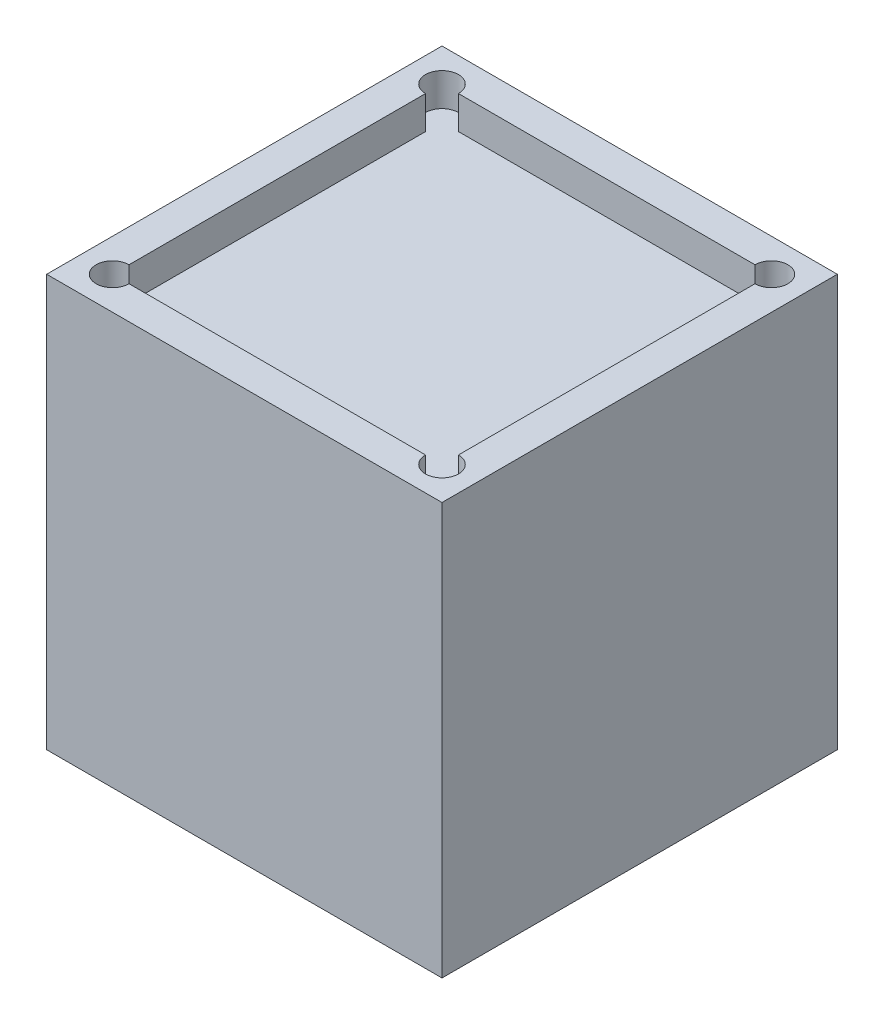
ISO-10303-21;
HEADER;
FILE_DESCRIPTION(('STEP AP214'),'2;1');
FILE_NAME('part.step','',(''),(''),'','','');
FILE_SCHEMA(('AUTOMOTIVE_DESIGN { 1 0 10303 214 1 1 1 1 }'));
ENDSEC;
DATA;
#1=APPLICATION_CONTEXT('core data for automotive mechanical design processes');
#2=APPLICATION_PROTOCOL_DEFINITION('international standard','automotive_design',2000,#1);
#3=PRODUCT_CONTEXT('',#1,'mechanical');
#4=PRODUCT('Part','Part','',(#3));
#5=PRODUCT_RELATED_PRODUCT_CATEGORY('part','',(#4));
#6=PRODUCT_DEFINITION_FORMATION('','',#4);
#7=PRODUCT_DEFINITION_CONTEXT('part definition',#1,'design');
#8=PRODUCT_DEFINITION('design','',#6,#7);
#9=PRODUCT_DEFINITION_SHAPE('','',#8);
#10=(LENGTH_UNIT() NAMED_UNIT(*) SI_UNIT(.MILLI.,.METRE.));
#11=(NAMED_UNIT(*) PLANE_ANGLE_UNIT() SI_UNIT($,.RADIAN.));
#12=(NAMED_UNIT(*) SI_UNIT($,.STERADIAN.) SOLID_ANGLE_UNIT());
#13=UNCERTAINTY_MEASURE_WITH_UNIT(LENGTH_MEASURE(1.E-05),#10,'distance_accuracy_value','');
#14=(GEOMETRIC_REPRESENTATION_CONTEXT(3) GLOBAL_UNCERTAINTY_ASSIGNED_CONTEXT((#13)) GLOBAL_UNIT_ASSIGNED_CONTEXT((#10,
#11,#12)) REPRESENTATION_CONTEXT('',''));
#15=CARTESIAN_POINT('',(0.,0.,0.));
#16=DIRECTION('',(0.,0.,1.));
#17=DIRECTION('',(1.,0.,0.));
#18=AXIS2_PLACEMENT_3D('',#15,#16,#17);
#19=CARTESIAN_POINT('',(6.,11.5,6.));
#20=DIRECTION('',(-1.,0.,0.));
#21=DIRECTION('',(0.,0.,1.));
#22=AXIS2_PLACEMENT_3D('',#19,#20,#21);
#23=PLANE('',#22);
#24=DIRECTION('',(0.,0.,-1.));
#25=VECTOR('',#24,1.);
#26=CARTESIAN_POINT('',(6.,0.,6.));
#27=LINE('',#26,#25);
#28=CARTESIAN_POINT('',(6.,0.,6.));
#29=VERTEX_POINT('',#28);
#30=CARTESIAN_POINT('',(6.,0.,-6.));
#31=VERTEX_POINT('',#30);
#32=EDGE_CURVE('E228',#29,#31,#27,.T.);
#33=ORIENTED_EDGE('',*,*,#32,.T.);
#34=DIRECTION('',(0.,-1.,0.));
#35=VECTOR('',#34,1.);
#36=CARTESIAN_POINT('',(6.,11.5,-6.));
#37=LINE('',#36,#35);
#38=CARTESIAN_POINT('',(6.,12.5,-6.));
#39=VERTEX_POINT('',#38);
#40=EDGE_CURVE('E11',#39,#31,#37,.T.);
#41=ORIENTED_EDGE('',*,*,#40,.F.);
#42=DIRECTION('',(0.,0.,-1.));
#43=VECTOR('',#42,1.);
#44=CARTESIAN_POINT('',(6.,12.5,6.));
#45=LINE('',#44,#43);
#46=CARTESIAN_POINT('',(6.,12.5,6.));
#47=VERTEX_POINT('',#46);
#48=EDGE_CURVE('E222',#47,#39,#45,.T.);
#49=ORIENTED_EDGE('',*,*,#48,.F.);
#50=DIRECTION('',(0.,-1.,0.));
#51=VECTOR('',#50,1.);
#52=CARTESIAN_POINT('',(6.,11.5,6.));
#53=LINE('',#52,#51);
#54=EDGE_CURVE('E237',#47,#29,#53,.T.);
#55=ORIENTED_EDGE('',*,*,#54,.T.);
#56=EDGE_LOOP('',(#33,#41,#49,#55));
#57=FACE_BOUND('',#56,.T.);
#58=ADVANCED_FACE('F39',(#57),#23,.F.);
#59=CARTESIAN_POINT('',(-6.,11.5,-6.));
#60=DIRECTION('',(0.,0.,1.));
#61=DIRECTION('',(1.,0.,0.));
#62=AXIS2_PLACEMENT_3D('',#59,#60,#61);
#63=PLANE('',#62);
#64=DIRECTION('',(-1.,0.,0.));
#65=VECTOR('',#64,1.);
#66=CARTESIAN_POINT('',(-6.,0.,-6.));
#67=LINE('',#66,#65);
#68=CARTESIAN_POINT('',(-6.,0.,-6.));
#69=VERTEX_POINT('',#68);
#70=EDGE_CURVE('E231',#31,#69,#67,.T.);
#71=ORIENTED_EDGE('',*,*,#70,.T.);
#72=DIRECTION('',(0.,-1.,0.));
#73=VECTOR('',#72,1.);
#74=CARTESIAN_POINT('',(-6.,11.5,-6.));
#75=LINE('',#74,#73);
#76=CARTESIAN_POINT('',(-6.,12.5,-6.));
#77=VERTEX_POINT('',#76);
#78=EDGE_CURVE('E46',#77,#69,#75,.T.);
#79=ORIENTED_EDGE('',*,*,#78,.F.);
#80=DIRECTION('',(-1.,0.,0.));
#81=VECTOR('',#80,1.);
#82=CARTESIAN_POINT('',(6.,12.5,-6.));
#83=LINE('',#82,#81);
#84=EDGE_CURVE('E225',#39,#77,#83,.T.);
#85=ORIENTED_EDGE('',*,*,#84,.F.);
#86=ORIENTED_EDGE('',*,*,#40,.T.);
#87=EDGE_LOOP('',(#71,#79,#85,#86));
#88=FACE_BOUND('',#87,.T.);
#89=ADVANCED_FACE('F260',(#88),#63,.F.);
#90=CARTESIAN_POINT('',(-6.,11.5,6.));
#91=DIRECTION('',(1.,0.,0.));
#92=DIRECTION('',(0.,0.,-1.));
#93=AXIS2_PLACEMENT_3D('',#90,#91,#92);
#94=PLANE('',#93);
#95=DIRECTION('',(0.,0.,1.));
#96=VECTOR('',#95,1.);
#97=CARTESIAN_POINT('',(-6.,0.,6.));
#98=LINE('',#97,#96);
#99=CARTESIAN_POINT('',(-6.,0.,6.));
#100=VERTEX_POINT('',#99);
#101=EDGE_CURVE('E233',#69,#100,#98,.T.);
#102=ORIENTED_EDGE('',*,*,#101,.T.);
#103=DIRECTION('',(0.,-1.,0.));
#104=VECTOR('',#103,1.);
#105=CARTESIAN_POINT('',(-6.,11.5,6.));
#106=LINE('',#105,#104);
#107=CARTESIAN_POINT('',(-6.,12.5,6.));
#108=VERTEX_POINT('',#107);
#109=EDGE_CURVE('E240',#108,#100,#106,.T.);
#110=ORIENTED_EDGE('',*,*,#109,.F.);
#111=DIRECTION('',(0.,0.,1.));
#112=VECTOR('',#111,1.);
#113=CARTESIAN_POINT('',(-6.,12.5,6.));
#114=LINE('',#113,#112);
#115=EDGE_CURVE('E209',#77,#108,#114,.T.);
#116=ORIENTED_EDGE('',*,*,#115,.F.);
#117=ORIENTED_EDGE('',*,*,#78,.T.);
#118=EDGE_LOOP('',(#102,#110,#116,#117));
#119=FACE_BOUND('',#118,.T.);
#120=ADVANCED_FACE('F246',(#119),#94,.F.);
#121=CARTESIAN_POINT('',(-6.,11.5,6.));
#122=DIRECTION('',(0.,0.,-1.));
#123=DIRECTION('',(-1.,0.,0.));
#124=AXIS2_PLACEMENT_3D('',#121,#122,#123);
#125=PLANE('',#124);
#126=DIRECTION('',(1.,0.,0.));
#127=VECTOR('',#126,1.);
#128=CARTESIAN_POINT('',(-6.,0.,6.));
#129=LINE('',#128,#127);
#130=EDGE_CURVE('E235',#100,#29,#129,.T.);
#131=ORIENTED_EDGE('',*,*,#130,.T.);
#132=ORIENTED_EDGE('',*,*,#54,.F.);
#133=DIRECTION('',(1.,0.,0.));
#134=VECTOR('',#133,1.);
#135=CARTESIAN_POINT('',(6.,12.5,6.));
#136=LINE('',#135,#134);
#137=EDGE_CURVE('E219',#108,#47,#136,.T.);
#138=ORIENTED_EDGE('',*,*,#137,.F.);
#139=ORIENTED_EDGE('',*,*,#109,.T.);
#140=EDGE_LOOP('',(#131,#132,#138,#139));
#141=FACE_BOUND('',#140,.T.);
#142=ADVANCED_FACE('F254',(#141),#125,.F.);
#143=CARTESIAN_POINT('',(0.,0.,0.));
#144=DIRECTION('',(0.,-1.,0.));
#145=DIRECTION('',(0.,0.,-1.));
#146=AXIS2_PLACEMENT_3D('',#143,#144,#145);
#147=PLANE('',#146);
#148=CARTESIAN_POINT('',(-3.87867965644036,0.,3.87867965644036));
#149=DIRECTION('',(0.,-1.,0.));
#150=DIRECTION('',(0.,0.,-1.));
#151=AXIS2_PLACEMENT_3D('',#148,#149,#150);
#152=CIRCLE('',#151,0.799999999999999);
#153=CARTESIAN_POINT('',(-3.87867965644036,0.,3.07867965644036));
#154=VERTEX_POINT('',#153);
#155=EDGE_CURVE('E141',#154,#154,#152,.T.);
#156=ORIENTED_EDGE('',*,*,#155,.F.);
#157=EDGE_LOOP('',(#156));
#158=FACE_BOUND('',#157,.T.);
#159=CARTESIAN_POINT('',(3.87867965644036,0.,-3.87867965644036));
#160=DIRECTION('',(0.,-1.,0.));
#161=DIRECTION('',(0.,0.,-1.));
#162=AXIS2_PLACEMENT_3D('',#159,#160,#161);
#163=CIRCLE('',#162,0.799999999999999);
#164=CARTESIAN_POINT('',(3.87867965644036,0.,-4.67867965644036));
#165=VERTEX_POINT('',#164);
#166=EDGE_CURVE('E140',#165,#165,#163,.T.);
#167=ORIENTED_EDGE('',*,*,#166,.F.);
#168=EDGE_LOOP('',(#167));
#169=FACE_BOUND('',#168,.T.);
#170=CARTESIAN_POINT('',(-3.87867965644036,0.,-3.87867965644036));
#171=DIRECTION('',(0.,-1.,0.));
#172=DIRECTION('',(0.,0.,-1.));
#173=AXIS2_PLACEMENT_3D('',#170,#171,#172);
#174=CIRCLE('',#173,0.793749999999999);
#175=CARTESIAN_POINT('',(-3.87867965644036,0.,-4.67242965644036));
#176=VERTEX_POINT('',#175);
#177=EDGE_CURVE('E151',#176,#176,#174,.T.);
#178=ORIENTED_EDGE('',*,*,#177,.F.);
#179=EDGE_LOOP('',(#178));
#180=FACE_BOUND('',#179,.T.);
#181=CARTESIAN_POINT('',(3.87867965644036,0.,3.87867965644036));
#182=DIRECTION('',(0.,-1.,0.));
#183=DIRECTION('',(0.,0.,-1.));
#184=AXIS2_PLACEMENT_3D('',#181,#182,#183);
#185=CIRCLE('',#184,0.793749999999999);
#186=CARTESIAN_POINT('',(3.87867965644036,0.,3.08492965644036));
#187=VERTEX_POINT('',#186);
#188=EDGE_CURVE('E157',#187,#187,#185,.T.);
#189=ORIENTED_EDGE('',*,*,#188,.F.);
#190=EDGE_LOOP('',(#189));
#191=FACE_BOUND('',#190,.T.);
#192=ORIENTED_EDGE('',*,*,#32,.F.);
#193=ORIENTED_EDGE('',*,*,#130,.F.);
#194=ORIENTED_EDGE('',*,*,#101,.F.);
#195=ORIENTED_EDGE('',*,*,#70,.F.);
#196=EDGE_LOOP('',(#192,#193,#194,#195));
#197=FACE_BOUND('',#196,.T.);
#198=ADVANCED_FACE('F252',(#158,#169,#180,#191,#197),#147,.T.);
#199=CARTESIAN_POINT('',(0.,12.5,0.));
#200=DIRECTION('',(0.,1.,0.));
#201=DIRECTION('',(0.,0.,1.));
#202=AXIS2_PLACEMENT_3D('',#199,#200,#201);
#203=PLANE('',#202);
#204=CARTESIAN_POINT('',(-5.,12.5,-5.));
#205=DIRECTION('',(0.,1.,0.));
#206=DIRECTION('',(0.,0.,1.));
#207=AXIS2_PLACEMENT_3D('',#204,#205,#206);
#208=CIRCLE('',#207,0.5);
#209=CARTESIAN_POINT('',(-4.5,12.5,-5.));
#210=VERTEX_POINT('',#209);
#211=CARTESIAN_POINT('',(-5.,12.5,-4.5));
#212=VERTEX_POINT('',#211);
#213=EDGE_CURVE('E163',#210,#212,#208,.T.);
#214=ORIENTED_EDGE('',*,*,#213,.F.);
#215=DIRECTION('',(-1.,0.,0.));
#216=VECTOR('',#215,1.);
#217=CARTESIAN_POINT('',(-5.,12.5,-5.));
#218=LINE('',#217,#216);
#219=CARTESIAN_POINT('',(4.5,12.5,-5.));
#220=VERTEX_POINT('',#219);
#221=EDGE_CURVE('E200',#220,#210,#218,.T.);
#222=ORIENTED_EDGE('',*,*,#221,.F.);
#223=CARTESIAN_POINT('',(5.,12.5,-5.));
#224=DIRECTION('',(0.,1.,0.));
#225=DIRECTION('',(0.,0.,1.));
#226=AXIS2_PLACEMENT_3D('',#223,#224,#225);
#227=CIRCLE('',#226,0.5);
#228=CARTESIAN_POINT('',(5.,12.5,-4.5));
#229=VERTEX_POINT('',#228);
#230=EDGE_CURVE('E170',#229,#220,#227,.T.);
#231=ORIENTED_EDGE('',*,*,#230,.F.);
#232=DIRECTION('',(0.,0.,-1.));
#233=VECTOR('',#232,1.);
#234=CARTESIAN_POINT('',(5.,12.5,5.));
#235=LINE('',#234,#233);
#236=CARTESIAN_POINT('',(5.,12.5,4.5));
#237=VERTEX_POINT('',#236);
#238=EDGE_CURVE('E197',#237,#229,#235,.T.);
#239=ORIENTED_EDGE('',*,*,#238,.F.);
#240=CARTESIAN_POINT('',(5.,12.5,5.));
#241=DIRECTION('',(0.,1.,0.));
#242=DIRECTION('',(0.,0.,1.));
#243=AXIS2_PLACEMENT_3D('',#240,#241,#242);
#244=CIRCLE('',#243,0.5);
#245=CARTESIAN_POINT('',(4.5,12.5,5.));
#246=VERTEX_POINT('',#245);
#247=EDGE_CURVE('E177',#246,#237,#244,.T.);
#248=ORIENTED_EDGE('',*,*,#247,.F.);
#249=DIRECTION('',(1.,0.,0.));
#250=VECTOR('',#249,1.);
#251=CARTESIAN_POINT('',(-5.,12.5,5.));
#252=LINE('',#251,#250);
#253=CARTESIAN_POINT('',(-4.5,12.5,5.));
#254=VERTEX_POINT('',#253);
#255=EDGE_CURVE('E206',#254,#246,#252,.T.);
#256=ORIENTED_EDGE('',*,*,#255,.F.);
#257=CARTESIAN_POINT('',(-5.,12.5,5.));
#258=DIRECTION('',(0.,1.,0.));
#259=DIRECTION('',(0.,0.,1.));
#260=AXIS2_PLACEMENT_3D('',#257,#258,#259);
#261=CIRCLE('',#260,0.5);
#262=CARTESIAN_POINT('',(-5.,12.5,4.5));
#263=VERTEX_POINT('',#262);
#264=EDGE_CURVE('E186',#263,#254,#261,.T.);
#265=ORIENTED_EDGE('',*,*,#264,.F.);
#266=DIRECTION('',(0.,0.,1.));
#267=VECTOR('',#266,1.);
#268=CARTESIAN_POINT('',(-5.,12.5,5.));
#269=LINE('',#268,#267);
#270=EDGE_CURVE('E204',#212,#263,#269,.T.);
#271=ORIENTED_EDGE('',*,*,#270,.F.);
#272=EDGE_LOOP('',(#214,#222,#231,#239,#248,#256,#265,#271));
#273=FACE_BOUND('',#272,.T.);
#274=ORIENTED_EDGE('',*,*,#115,.T.);
#275=ORIENTED_EDGE('',*,*,#137,.T.);
#276=ORIENTED_EDGE('',*,*,#48,.T.);
#277=ORIENTED_EDGE('',*,*,#84,.T.);
#278=EDGE_LOOP('',(#274,#275,#276,#277));
#279=FACE_BOUND('',#278,.T.);
#280=ADVANCED_FACE('F259',(#273,#279),#203,.T.);
#281=CARTESIAN_POINT('',(5.,12.5,5.));
#282=DIRECTION('',(-1.,0.,0.));
#283=DIRECTION('',(0.,0.,1.));
#284=AXIS2_PLACEMENT_3D('',#281,#282,#283);
#285=PLANE('',#284);
#286=DIRECTION('',(0.,1.,0.));
#287=VECTOR('',#286,1.);
#288=CARTESIAN_POINT('',(5.,12.5,-4.5));
#289=LINE('',#288,#287);
#290=CARTESIAN_POINT('',(5.,11.5,-4.5));
#291=VERTEX_POINT('',#290);
#292=EDGE_CURVE('E175',#291,#229,#289,.T.);
#293=ORIENTED_EDGE('',*,*,#292,.F.);
#294=DIRECTION('',(0.,0.,-1.));
#295=VECTOR('',#294,1.);
#296=CARTESIAN_POINT('',(5.,11.5,5.));
#297=LINE('',#296,#295);
#298=CARTESIAN_POINT('',(5.,11.5,4.5));
#299=VERTEX_POINT('',#298);
#300=EDGE_CURVE('E196',#299,#291,#297,.T.);
#301=ORIENTED_EDGE('',*,*,#300,.F.);
#302=DIRECTION('',(0.,1.,0.));
#303=VECTOR('',#302,1.);
#304=CARTESIAN_POINT('',(5.,12.5,4.5));
#305=LINE('',#304,#303);
#306=EDGE_CURVE('E183',#237,#299,#305,.F.);
#307=ORIENTED_EDGE('',*,*,#306,.F.);
#308=ORIENTED_EDGE('',*,*,#238,.T.);
#309=EDGE_LOOP('',(#293,#301,#307,#308));
#310=FACE_BOUND('',#309,.T.);
#311=ADVANCED_FACE('F280',(#310),#285,.T.);
#312=CARTESIAN_POINT('',(-5.,12.5,-5.));
#313=DIRECTION('',(0.,0.,1.));
#314=DIRECTION('',(1.,0.,0.));
#315=AXIS2_PLACEMENT_3D('',#312,#313,#314);
#316=PLANE('',#315);
#317=DIRECTION('',(0.,1.,0.));
#318=VECTOR('',#317,1.);
#319=CARTESIAN_POINT('',(-4.5,12.5,-5.));
#320=LINE('',#319,#318);
#321=CARTESIAN_POINT('',(-4.5,11.5,-5.));
#322=VERTEX_POINT('',#321);
#323=EDGE_CURVE('E168',#322,#210,#320,.T.);
#324=ORIENTED_EDGE('',*,*,#323,.F.);
#325=DIRECTION('',(-1.,0.,0.));
#326=VECTOR('',#325,1.);
#327=CARTESIAN_POINT('',(-5.,11.5,-5.));
#328=LINE('',#327,#326);
#329=CARTESIAN_POINT('',(4.5,11.5,-5.));
#330=VERTEX_POINT('',#329);
#331=EDGE_CURVE('E211',#330,#322,#328,.T.);
#332=ORIENTED_EDGE('',*,*,#331,.F.);
#333=DIRECTION('',(0.,1.,0.));
#334=VECTOR('',#333,1.);
#335=CARTESIAN_POINT('',(4.5,12.5,-5.));
#336=LINE('',#335,#334);
#337=EDGE_CURVE('E173',#220,#330,#336,.F.);
#338=ORIENTED_EDGE('',*,*,#337,.F.);
#339=ORIENTED_EDGE('',*,*,#221,.T.);
#340=EDGE_LOOP('',(#324,#332,#338,#339));
#341=FACE_BOUND('',#340,.T.);
#342=ADVANCED_FACE('F284',(#341),#316,.T.);
#343=CARTESIAN_POINT('',(-5.,12.5,5.));
#344=DIRECTION('',(1.,0.,0.));
#345=DIRECTION('',(0.,0.,-1.));
#346=AXIS2_PLACEMENT_3D('',#343,#344,#345);
#347=PLANE('',#346);
#348=DIRECTION('',(0.,1.,0.));
#349=VECTOR('',#348,1.);
#350=CARTESIAN_POINT('',(-5.,12.5,-4.5));
#351=LINE('',#350,#349);
#352=CARTESIAN_POINT('',(-5.,11.5,-4.5));
#353=VERTEX_POINT('',#352);
#354=EDGE_CURVE('E166',#212,#353,#351,.F.);
#355=ORIENTED_EDGE('',*,*,#354,.F.);
#356=ORIENTED_EDGE('',*,*,#270,.T.);
#357=DIRECTION('',(0.,1.,0.));
#358=VECTOR('',#357,1.);
#359=CARTESIAN_POINT('',(-5.,12.5,4.5));
#360=LINE('',#359,#358);
#361=CARTESIAN_POINT('',(-5.,11.5,4.5));
#362=VERTEX_POINT('',#361);
#363=EDGE_CURVE('E191',#362,#263,#360,.T.);
#364=ORIENTED_EDGE('',*,*,#363,.F.);
#365=DIRECTION('',(0.,0.,1.));
#366=VECTOR('',#365,1.);
#367=CARTESIAN_POINT('',(-5.,11.5,5.));
#368=LINE('',#367,#366);
#369=EDGE_CURVE('E213',#353,#362,#368,.T.);
#370=ORIENTED_EDGE('',*,*,#369,.F.);
#371=EDGE_LOOP('',(#355,#356,#364,#370));
#372=FACE_BOUND('',#371,.T.);
#373=ADVANCED_FACE('F288',(#372),#347,.T.);
#374=CARTESIAN_POINT('',(-5.,12.5,5.));
#375=DIRECTION('',(0.,0.,-1.));
#376=DIRECTION('',(-1.,0.,0.));
#377=AXIS2_PLACEMENT_3D('',#374,#375,#376);
#378=PLANE('',#377);
#379=DIRECTION('',(0.,1.,0.));
#380=VECTOR('',#379,1.);
#381=CARTESIAN_POINT('',(4.5,12.5,5.));
#382=LINE('',#381,#380);
#383=CARTESIAN_POINT('',(4.5,11.5,5.));
#384=VERTEX_POINT('',#383);
#385=EDGE_CURVE('E181',#384,#246,#382,.T.);
#386=ORIENTED_EDGE('',*,*,#385,.F.);
#387=DIRECTION('',(1.,0.,0.));
#388=VECTOR('',#387,1.);
#389=CARTESIAN_POINT('',(-5.,11.5,5.));
#390=LINE('',#389,#388);
#391=CARTESIAN_POINT('',(-4.5,11.5,5.));
#392=VERTEX_POINT('',#391);
#393=EDGE_CURVE('E201',#392,#384,#390,.T.);
#394=ORIENTED_EDGE('',*,*,#393,.F.);
#395=DIRECTION('',(0.,1.,0.));
#396=VECTOR('',#395,1.);
#397=CARTESIAN_POINT('',(-4.5,12.5,5.));
#398=LINE('',#397,#396);
#399=EDGE_CURVE('E194',#254,#392,#398,.F.);
#400=ORIENTED_EDGE('',*,*,#399,.F.);
#401=ORIENTED_EDGE('',*,*,#255,.T.);
#402=EDGE_LOOP('',(#386,#394,#400,#401));
#403=FACE_BOUND('',#402,.T.);
#404=ADVANCED_FACE('F277',(#403),#378,.T.);
#405=CARTESIAN_POINT('',(0.,11.5,0.));
#406=DIRECTION('',(0.,-1.,0.));
#407=DIRECTION('',(0.,0.,-1.));
#408=AXIS2_PLACEMENT_3D('',#405,#406,#407);
#409=PLANE('',#408);
#410=ORIENTED_EDGE('',*,*,#331,.T.);
#411=CARTESIAN_POINT('',(-5.,11.5,-5.));
#412=DIRECTION('',(0.,1.,0.));
#413=DIRECTION('',(0.,0.,1.));
#414=AXIS2_PLACEMENT_3D('',#411,#412,#413);
#415=CIRCLE('',#414,0.5);
#416=EDGE_CURVE('E53',#322,#353,#415,.T.);
#417=ORIENTED_EDGE('',*,*,#416,.T.);
#418=ORIENTED_EDGE('',*,*,#369,.T.);
#419=CARTESIAN_POINT('',(-5.,11.5,5.));
#420=DIRECTION('',(0.,1.,0.));
#421=DIRECTION('',(0.,0.,1.));
#422=AXIS2_PLACEMENT_3D('',#419,#420,#421);
#423=CIRCLE('',#422,0.5);
#424=EDGE_CURVE('E188',#362,#392,#423,.T.);
#425=ORIENTED_EDGE('',*,*,#424,.T.);
#426=ORIENTED_EDGE('',*,*,#393,.T.);
#427=CARTESIAN_POINT('',(5.,11.5,5.));
#428=DIRECTION('',(0.,1.,0.));
#429=DIRECTION('',(0.,0.,1.));
#430=AXIS2_PLACEMENT_3D('',#427,#428,#429);
#431=CIRCLE('',#430,0.5);
#432=EDGE_CURVE('E179',#384,#299,#431,.T.);
#433=ORIENTED_EDGE('',*,*,#432,.T.);
#434=ORIENTED_EDGE('',*,*,#300,.T.);
#435=CARTESIAN_POINT('',(5.,11.5,-5.));
#436=DIRECTION('',(0.,1.,0.));
#437=DIRECTION('',(0.,0.,1.));
#438=AXIS2_PLACEMENT_3D('',#435,#436,#437);
#439=CIRCLE('',#438,0.5);
#440=EDGE_CURVE('E59',#291,#330,#439,.T.);
#441=ORIENTED_EDGE('',*,*,#440,.T.);
#442=EDGE_LOOP('',(#410,#417,#418,#425,#426,#433,#434,#441));
#443=FACE_BOUND('',#442,.T.);
#444=ADVANCED_FACE('F273',(#443),#409,.F.);
#445=CARTESIAN_POINT('',(-5.,12.5,5.));
#446=DIRECTION('',(0.,1.,0.));
#447=DIRECTION('',(0.,0.,1.));
#448=AXIS2_PLACEMENT_3D('',#445,#446,#447);
#449=CYLINDRICAL_SURFACE('',#448,0.5);
#450=ORIENTED_EDGE('',*,*,#399,.T.);
#451=ORIENTED_EDGE('',*,*,#424,.F.);
#452=ORIENTED_EDGE('',*,*,#363,.T.);
#453=ORIENTED_EDGE('',*,*,#264,.T.);
#454=EDGE_LOOP('',(#450,#451,#452,#453));
#455=FACE_BOUND('',#454,.T.);
#456=ADVANCED_FACE('F276',(#455),#449,.F.);
#457=CARTESIAN_POINT('',(5.,12.5,5.));
#458=DIRECTION('',(0.,1.,0.));
#459=DIRECTION('',(0.,0.,1.));
#460=AXIS2_PLACEMENT_3D('',#457,#458,#459);
#461=CYLINDRICAL_SURFACE('',#460,0.5);
#462=ORIENTED_EDGE('',*,*,#306,.T.);
#463=ORIENTED_EDGE('',*,*,#432,.F.);
#464=ORIENTED_EDGE('',*,*,#385,.T.);
#465=ORIENTED_EDGE('',*,*,#247,.T.);
#466=EDGE_LOOP('',(#462,#463,#464,#465));
#467=FACE_BOUND('',#466,.T.);
#468=ADVANCED_FACE('F298',(#467),#461,.F.);
#469=CARTESIAN_POINT('',(5.,12.5,-5.));
#470=DIRECTION('',(0.,1.,0.));
#471=DIRECTION('',(0.,0.,1.));
#472=AXIS2_PLACEMENT_3D('',#469,#470,#471);
#473=CYLINDRICAL_SURFACE('',#472,0.5);
#474=ORIENTED_EDGE('',*,*,#292,.T.);
#475=ORIENTED_EDGE('',*,*,#230,.T.);
#476=ORIENTED_EDGE('',*,*,#337,.T.);
#477=ORIENTED_EDGE('',*,*,#440,.F.);
#478=EDGE_LOOP('',(#474,#475,#476,#477));
#479=FACE_BOUND('',#478,.T.);
#480=ADVANCED_FACE('F302',(#479),#473,.F.);
#481=CARTESIAN_POINT('',(-5.,12.5,-5.));
#482=DIRECTION('',(0.,1.,0.));
#483=DIRECTION('',(0.,0.,1.));
#484=AXIS2_PLACEMENT_3D('',#481,#482,#483);
#485=CYLINDRICAL_SURFACE('',#484,0.5);
#486=ORIENTED_EDGE('',*,*,#323,.T.);
#487=ORIENTED_EDGE('',*,*,#213,.T.);
#488=ORIENTED_EDGE('',*,*,#354,.T.);
#489=ORIENTED_EDGE('',*,*,#416,.F.);
#490=EDGE_LOOP('',(#486,#487,#488,#489));
#491=FACE_BOUND('',#490,.T.);
#492=ADVANCED_FACE('F306',(#491),#485,.F.);
#493=CARTESIAN_POINT('',(3.87867965644035,7.5,3.87867965644036));
#494=DIRECTION('',(0.,1.,0.));
#495=DIRECTION('',(0.,0.,1.));
#496=AXIS2_PLACEMENT_3D('',#493,#494,#495);
#497=PLANE('',#496);
#498=CARTESIAN_POINT('',(3.87867965644036,7.5,3.87867965644036));
#499=DIRECTION('',(0.,-1.,0.));
#500=DIRECTION('',(0.,0.,-1.));
#501=AXIS2_PLACEMENT_3D('',#498,#499,#500);
#502=CIRCLE('',#501,0.793749999999998);
#503=CARTESIAN_POINT('',(3.87867965644036,7.5,3.08492965644036));
#504=VERTEX_POINT('',#503);
#505=EDGE_CURVE('E160',#504,#504,#502,.T.);
#506=ORIENTED_EDGE('',*,*,#505,.T.);
#507=EDGE_LOOP('',(#506));
#508=FACE_BOUND('',#507,.T.);
#509=ADVANCED_FACE('F310',(#508),#497,.F.);
#510=CARTESIAN_POINT('',(3.87867965644036,0.,3.87867965644036));
#511=DIRECTION('',(0.,-1.,0.));
#512=DIRECTION('',(0.,0.,-1.));
#513=AXIS2_PLACEMENT_3D('',#510,#511,#512);
#514=CYLINDRICAL_SURFACE('',#513,0.793749999999998);
#515=ORIENTED_EDGE('',*,*,#505,.F.);
#516=EDGE_LOOP('',(#515));
#517=FACE_BOUND('',#516,.T.);
#518=ORIENTED_EDGE('',*,*,#188,.T.);
#519=EDGE_LOOP('',(#518));
#520=FACE_BOUND('',#519,.T.);
#521=ADVANCED_FACE('F314',(#517,#520),#514,.F.);
#522=CARTESIAN_POINT('',(-3.87867965644036,7.5,-3.87867965644036));
#523=DIRECTION('',(0.,1.,0.));
#524=DIRECTION('',(0.,0.,1.));
#525=AXIS2_PLACEMENT_3D('',#522,#523,#524);
#526=PLANE('',#525);
#527=CARTESIAN_POINT('',(-3.87867965644036,7.5,-3.87867965644036));
#528=DIRECTION('',(0.,-1.,0.));
#529=DIRECTION('',(0.,0.,-1.));
#530=AXIS2_PLACEMENT_3D('',#527,#528,#529);
#531=CIRCLE('',#530,0.793749999999998);
#532=CARTESIAN_POINT('',(-3.87867965644036,7.5,-4.67242965644036));
#533=VERTEX_POINT('',#532);
#534=EDGE_CURVE('E154',#533,#533,#531,.T.);
#535=ORIENTED_EDGE('',*,*,#534,.T.);
#536=EDGE_LOOP('',(#535));
#537=FACE_BOUND('',#536,.T.);
#538=ADVANCED_FACE('F318',(#537),#526,.F.);
#539=CARTESIAN_POINT('',(-3.87867965644036,0.,-3.87867965644036));
#540=DIRECTION('',(0.,-1.,0.));
#541=DIRECTION('',(0.,0.,-1.));
#542=AXIS2_PLACEMENT_3D('',#539,#540,#541);
#543=CYLINDRICAL_SURFACE('',#542,0.793749999999999);
#544=ORIENTED_EDGE('',*,*,#534,.F.);
#545=EDGE_LOOP('',(#544));
#546=FACE_BOUND('',#545,.T.);
#547=ORIENTED_EDGE('',*,*,#177,.T.);
#548=EDGE_LOOP('',(#547));
#549=FACE_BOUND('',#548,.T.);
#550=ADVANCED_FACE('F322',(#546,#549),#543,.F.);
#551=CARTESIAN_POINT('',(3.87867965644036,5.2,-3.87867965644036));
#552=DIRECTION('',(0.,-1.,0.));
#553=DIRECTION('',(0.,0.,-1.));
#554=AXIS2_PLACEMENT_3D('',#551,#552,#553);
#555=CONICAL_SURFACE('',#554,0.799999999999999,1.02974425867665);
#556=CARTESIAN_POINT('',(3.87867965644036,5.68068849522205,-3.87867965644036));
#557=VERTEX_POINT('',#556);
#558=VERTEX_LOOP('',#557);
#559=FACE_BOUND('',#558,.T.);
#560=CARTESIAN_POINT('',(3.87867965644036,5.2,-3.87867965644036));
#561=DIRECTION('',(0.,-1.,0.));
#562=DIRECTION('',(0.,0.,-1.));
#563=AXIS2_PLACEMENT_3D('',#560,#561,#562);
#564=CIRCLE('',#563,0.799999999999999);
#565=CARTESIAN_POINT('',(3.87867965644036,5.2,-4.67867965644036));
#566=VERTEX_POINT('',#565);
#567=EDGE_CURVE('E144',#566,#566,#564,.T.);
#568=ORIENTED_EDGE('',*,*,#567,.T.);
#569=EDGE_LOOP('',(#568));
#570=FACE_BOUND('',#569,.T.);
#571=ADVANCED_FACE('F326',(#559,#570),#555,.F.);
#572=CARTESIAN_POINT('',(3.87867965644036,0.,-3.87867965644036));
#573=DIRECTION('',(0.,-1.,0.));
#574=DIRECTION('',(0.,0.,-1.));
#575=AXIS2_PLACEMENT_3D('',#572,#573,#574);
#576=CYLINDRICAL_SURFACE('',#575,0.799999999999999);
#577=ORIENTED_EDGE('',*,*,#567,.F.);
#578=EDGE_LOOP('',(#577));
#579=FACE_BOUND('',#578,.T.);
#580=ORIENTED_EDGE('',*,*,#166,.T.);
#581=EDGE_LOOP('',(#580));
#582=FACE_BOUND('',#581,.T.);
#583=ADVANCED_FACE('F134',(#579,#582),#576,.F.);
#584=CARTESIAN_POINT('',(-3.87867965644036,5.2,3.87867965644036));
#585=DIRECTION('',(0.,-1.,0.));
#586=DIRECTION('',(0.,0.,-1.));
#587=AXIS2_PLACEMENT_3D('',#584,#585,#586);
#588=CONICAL_SURFACE('',#587,0.799999999999999,1.02974425867665);
#589=CARTESIAN_POINT('',(-3.87867965644036,5.68068849522205,3.87867965644036));
#590=VERTEX_POINT('',#589);
#591=VERTEX_LOOP('',#590);
#592=FACE_BOUND('',#591,.T.);
#593=CARTESIAN_POINT('',(-3.87867965644036,5.2,3.87867965644036));
#594=DIRECTION('',(0.,-1.,0.));
#595=DIRECTION('',(0.,0.,-1.));
#596=AXIS2_PLACEMENT_3D('',#593,#594,#595);
#597=CIRCLE('',#596,0.799999999999999);
#598=CARTESIAN_POINT('',(-3.87867965644036,5.2,3.07867965644036));
#599=VERTEX_POINT('',#598);
#600=EDGE_CURVE('E138',#599,#599,#597,.T.);
#601=ORIENTED_EDGE('',*,*,#600,.T.);
#602=EDGE_LOOP('',(#601));
#603=FACE_BOUND('',#602,.T.);
#604=ADVANCED_FACE('F130',(#592,#603),#588,.F.);
#605=CARTESIAN_POINT('',(-3.87867965644036,0.,3.87867965644036));
#606=DIRECTION('',(0.,-1.,0.));
#607=DIRECTION('',(0.,0.,-1.));
#608=AXIS2_PLACEMENT_3D('',#605,#606,#607);
#609=CYLINDRICAL_SURFACE('',#608,0.799999999999999);
#610=ORIENTED_EDGE('',*,*,#600,.F.);
#611=EDGE_LOOP('',(#610));
#612=FACE_BOUND('',#611,.T.);
#613=ORIENTED_EDGE('',*,*,#155,.T.);
#614=EDGE_LOOP('',(#613));
#615=FACE_BOUND('',#614,.T.);
#616=ADVANCED_FACE('F133',(#612,#615),#609,.F.);
#617=CLOSED_SHELL('',(#58,#89,#120,#142,#198,#280,#311,#342,#373,#404,#444,#456,#468,#480,#492,
#509,#521,#538,#550,#571,#583,#604,#616));
#618=MANIFOLD_SOLID_BREP('B2',#617);
#619=ADVANCED_BREP_SHAPE_REPRESENTATION('',(#18,#618),#14);
#620=SHAPE_DEFINITION_REPRESENTATION(#9,#619);
ENDSEC;
END-ISO-10303-21;
